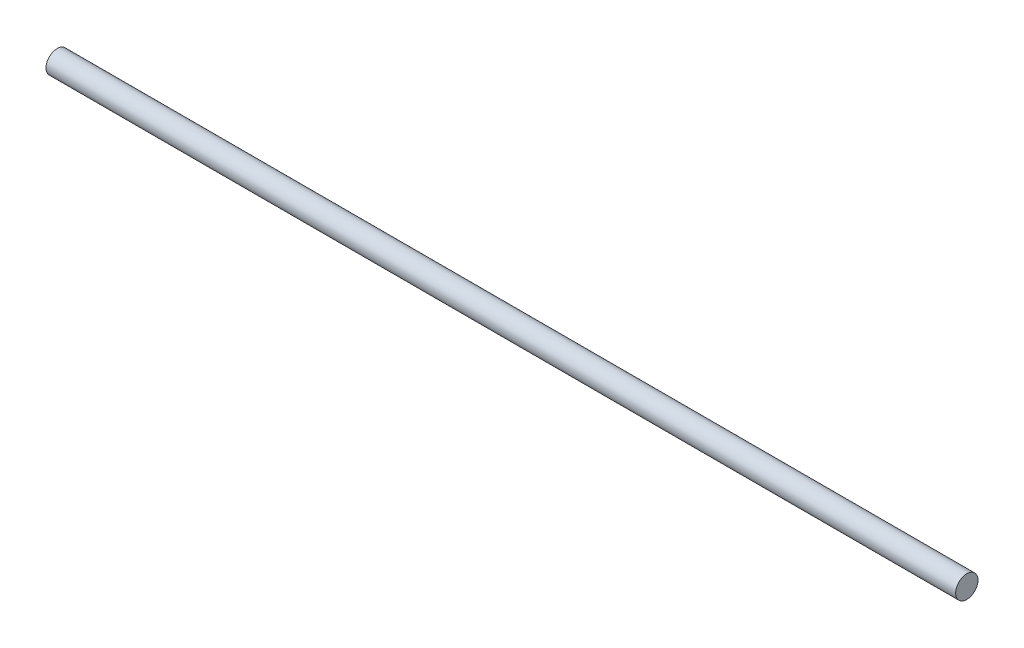
ISO-10303-21;
HEADER;
FILE_DESCRIPTION(('STEP AP214'),'2;1');
FILE_NAME('part.step','',(''),(''),'','','');
FILE_SCHEMA(('AUTOMOTIVE_DESIGN { 1 0 10303 214 1 1 1 1 }'));
ENDSEC;
DATA;
#1=APPLICATION_CONTEXT('core data for automotive mechanical design processes');
#2=APPLICATION_PROTOCOL_DEFINITION('international standard','automotive_design',2000,#1);
#3=PRODUCT_CONTEXT('',#1,'mechanical');
#4=PRODUCT('Part','Part','',(#3));
#5=PRODUCT_RELATED_PRODUCT_CATEGORY('part','',(#4));
#6=PRODUCT_DEFINITION_FORMATION('','',#4);
#7=PRODUCT_DEFINITION_CONTEXT('part definition',#1,'design');
#8=PRODUCT_DEFINITION('design','',#6,#7);
#9=PRODUCT_DEFINITION_SHAPE('','',#8);
#10=(LENGTH_UNIT() NAMED_UNIT(*) SI_UNIT(.MILLI.,.METRE.));
#11=(NAMED_UNIT(*) PLANE_ANGLE_UNIT() SI_UNIT($,.RADIAN.));
#12=(NAMED_UNIT(*) SI_UNIT($,.STERADIAN.) SOLID_ANGLE_UNIT());
#13=UNCERTAINTY_MEASURE_WITH_UNIT(LENGTH_MEASURE(1.E-05),#10,'distance_accuracy_value','');
#14=(GEOMETRIC_REPRESENTATION_CONTEXT(3) GLOBAL_UNCERTAINTY_ASSIGNED_CONTEXT((#13)) GLOBAL_UNIT_ASSIGNED_CONTEXT((#10,
#11,#12)) REPRESENTATION_CONTEXT('',''));
#15=CARTESIAN_POINT('',(0.,0.,0.));
#16=DIRECTION('',(0.,0.,1.));
#17=DIRECTION('',(1.,0.,0.));
#18=AXIS2_PLACEMENT_3D('',#15,#16,#17);
#19=CARTESIAN_POINT('',(-11.,0.,0.));
#20=DIRECTION('',(1.,0.,0.));
#21=DIRECTION('',(0.,0.,-1.));
#22=AXIS2_PLACEMENT_3D('',#19,#20,#21);
#23=CYLINDRICAL_SURFACE('',#22,0.750000000000001);
#24=CARTESIAN_POINT('',(-11.,0.,0.));
#25=DIRECTION('',(1.,0.,0.));
#26=DIRECTION('',(0.,0.,-1.));
#27=AXIS2_PLACEMENT_3D('',#24,#25,#26);
#28=CIRCLE('',#27,0.750000000000001);
#29=CARTESIAN_POINT('',(-11.,0.,-0.750000000000001));
#30=VERTEX_POINT('',#29);
#31=EDGE_CURVE('E10',#30,#30,#28,.T.);
#32=ORIENTED_EDGE('',*,*,#31,.T.);
#33=EDGE_LOOP('',(#32));
#34=FACE_BOUND('',#33,.T.);
#35=CARTESIAN_POINT('',(50.,0.,0.));
#36=DIRECTION('',(1.,0.,0.));
#37=DIRECTION('',(0.,0.,-1.));
#38=AXIS2_PLACEMENT_3D('',#35,#36,#37);
#39=CIRCLE('',#38,0.750000000000001);
#40=CARTESIAN_POINT('',(50.,0.,-0.750000000000001));
#41=VERTEX_POINT('',#40);
#42=EDGE_CURVE('E38',#41,#41,#39,.T.);
#43=ORIENTED_EDGE('',*,*,#42,.F.);
#44=EDGE_LOOP('',(#43));
#45=FACE_BOUND('',#44,.T.);
#46=ADVANCED_FACE('F32',(#34,#45),#23,.T.);
#47=CARTESIAN_POINT('',(-11.,0.,0.));
#48=DIRECTION('',(1.,0.,0.));
#49=DIRECTION('',(0.,0.,-1.));
#50=AXIS2_PLACEMENT_3D('',#47,#48,#49);
#51=PLANE('',#50);
#52=ORIENTED_EDGE('',*,*,#31,.F.);
#53=EDGE_LOOP('',(#52));
#54=FACE_BOUND('',#53,.T.);
#55=ADVANCED_FACE('F47',(#54),#51,.F.);
#56=CARTESIAN_POINT('',(50.,0.,0.));
#57=DIRECTION('',(1.,0.,0.));
#58=DIRECTION('',(0.,0.,-1.));
#59=AXIS2_PLACEMENT_3D('',#56,#57,#58);
#60=PLANE('',#59);
#61=ORIENTED_EDGE('',*,*,#42,.T.);
#62=EDGE_LOOP('',(#61));
#63=FACE_BOUND('',#62,.T.);
#64=ADVANCED_FACE('F44',(#63),#60,.T.);
#65=CLOSED_SHELL('',(#46,#55,#64));
#66=MANIFOLD_SOLID_BREP('B2',#65);
#67=ADVANCED_BREP_SHAPE_REPRESENTATION('',(#18,#66),#14);
#68=SHAPE_DEFINITION_REPRESENTATION(#9,#67);
ENDSEC;
END-ISO-10303-21;
